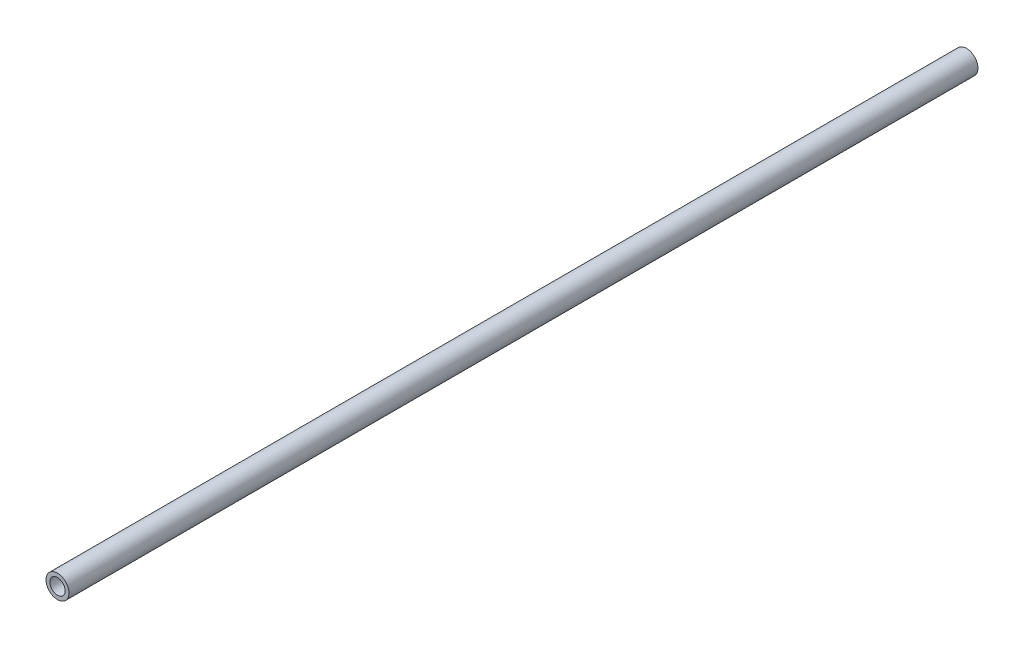
ISO-10303-21;
HEADER;
FILE_DESCRIPTION(('STEP AP214'),'2;1');
FILE_NAME('part.step','',(''),(''),'','','');
FILE_SCHEMA(('AUTOMOTIVE_DESIGN { 1 0 10303 214 1 1 1 1 }'));
ENDSEC;
DATA;
#1=APPLICATION_CONTEXT('core data for automotive mechanical design processes');
#2=APPLICATION_PROTOCOL_DEFINITION('international standard','automotive_design',2000,#1);
#3=PRODUCT_CONTEXT('',#1,'mechanical');
#4=PRODUCT('Part','Part','',(#3));
#5=PRODUCT_RELATED_PRODUCT_CATEGORY('part','',(#4));
#6=PRODUCT_DEFINITION_FORMATION('','',#4);
#7=PRODUCT_DEFINITION_CONTEXT('part definition',#1,'design');
#8=PRODUCT_DEFINITION('design','',#6,#7);
#9=PRODUCT_DEFINITION_SHAPE('','',#8);
#10=(LENGTH_UNIT() NAMED_UNIT(*) SI_UNIT(.MILLI.,.METRE.));
#11=(NAMED_UNIT(*) PLANE_ANGLE_UNIT() SI_UNIT($,.RADIAN.));
#12=(NAMED_UNIT(*) SI_UNIT($,.STERADIAN.) SOLID_ANGLE_UNIT());
#13=UNCERTAINTY_MEASURE_WITH_UNIT(LENGTH_MEASURE(1.E-05),#10,'distance_accuracy_value','');
#14=(GEOMETRIC_REPRESENTATION_CONTEXT(3) GLOBAL_UNCERTAINTY_ASSIGNED_CONTEXT((#13)) GLOBAL_UNIT_ASSIGNED_CONTEXT((#10,
#11,#12)) REPRESENTATION_CONTEXT('',''));
#15=CARTESIAN_POINT('',(0.,0.,0.));
#16=DIRECTION('',(0.,0.,1.));
#17=DIRECTION('',(1.,0.,0.));
#18=AXIS2_PLACEMENT_3D('',#15,#16,#17);
#19=CARTESIAN_POINT('',(0.,0.,948.));
#20=DIRECTION('',(0.,0.,1.));
#21=DIRECTION('',(1.,0.,0.));
#22=AXIS2_PLACEMENT_3D('',#19,#20,#21);
#23=PLANE('',#22);
#24=CARTESIAN_POINT('',(0.,0.,948.));
#25=DIRECTION('',(0.,0.,1.));
#26=DIRECTION('',(1.,0.,0.));
#27=AXIS2_PLACEMENT_3D('',#24,#25,#26);
#28=CIRCLE('',#27,12.);
#29=CARTESIAN_POINT('',(12.,0.,948.));
#30=VERTEX_POINT('',#29);
#31=EDGE_CURVE('E10',#30,#30,#28,.T.);
#32=ORIENTED_EDGE('',*,*,#31,.T.);
#33=EDGE_LOOP('',(#32));
#34=FACE_BOUND('',#33,.T.);
#35=CARTESIAN_POINT('',(0.,0.,948.));
#36=DIRECTION('',(0.,0.,1.));
#37=DIRECTION('',(1.,0.,0.));
#38=AXIS2_PLACEMENT_3D('',#35,#36,#37);
#39=CIRCLE('',#38,8.);
#40=CARTESIAN_POINT('',(8.,0.,948.));
#41=VERTEX_POINT('',#40);
#42=EDGE_CURVE('E54',#41,#41,#39,.T.);
#43=ORIENTED_EDGE('',*,*,#42,.F.);
#44=EDGE_LOOP('',(#43));
#45=FACE_BOUND('',#44,.T.);
#46=ADVANCED_FACE('F41',(#34,#45),#23,.T.);
#47=CARTESIAN_POINT('',(0.,0.,0.));
#48=DIRECTION('',(0.,0.,1.));
#49=DIRECTION('',(1.,0.,0.));
#50=AXIS2_PLACEMENT_3D('',#47,#48,#49);
#51=PLANE('',#50);
#52=CARTESIAN_POINT('',(0.,0.,0.));
#53=DIRECTION('',(0.,0.,1.));
#54=DIRECTION('',(1.,0.,0.));
#55=AXIS2_PLACEMENT_3D('',#52,#53,#54);
#56=CIRCLE('',#55,12.);
#57=CARTESIAN_POINT('',(12.,0.,0.));
#58=VERTEX_POINT('',#57);
#59=EDGE_CURVE('E45',#58,#58,#56,.T.);
#60=ORIENTED_EDGE('',*,*,#59,.F.);
#61=EDGE_LOOP('',(#60));
#62=FACE_BOUND('',#61,.T.);
#63=CARTESIAN_POINT('',(0.,0.,0.));
#64=DIRECTION('',(0.,0.,1.));
#65=DIRECTION('',(1.,0.,0.));
#66=AXIS2_PLACEMENT_3D('',#63,#64,#65);
#67=CIRCLE('',#66,8.);
#68=CARTESIAN_POINT('',(8.,0.,0.));
#69=VERTEX_POINT('',#68);
#70=EDGE_CURVE('E56',#69,#69,#67,.T.);
#71=ORIENTED_EDGE('',*,*,#70,.T.);
#72=EDGE_LOOP('',(#71));
#73=FACE_BOUND('',#72,.T.);
#74=ADVANCED_FACE('F68',(#62,#73),#51,.F.);
#75=CARTESIAN_POINT('',(0.,0.,948.));
#76=DIRECTION('',(0.,0.,-1.));
#77=DIRECTION('',(-1.,0.,0.));
#78=AXIS2_PLACEMENT_3D('',#75,#76,#77);
#79=CYLINDRICAL_SURFACE('',#78,12.);
#80=ORIENTED_EDGE('',*,*,#31,.F.);
#81=EDGE_LOOP('',(#80));
#82=FACE_BOUND('',#81,.T.);
#83=ORIENTED_EDGE('',*,*,#59,.T.);
#84=EDGE_LOOP('',(#83));
#85=FACE_BOUND('',#84,.T.);
#86=ADVANCED_FACE('F43',(#82,#85),#79,.T.);
#87=CARTESIAN_POINT('',(0.,0.,948.));
#88=DIRECTION('',(0.,0.,-1.));
#89=DIRECTION('',(-1.,0.,0.));
#90=AXIS2_PLACEMENT_3D('',#87,#88,#89);
#91=CYLINDRICAL_SURFACE('',#90,8.);
#92=ORIENTED_EDGE('',*,*,#42,.T.);
#93=EDGE_LOOP('',(#92));
#94=FACE_BOUND('',#93,.T.);
#95=ORIENTED_EDGE('',*,*,#70,.F.);
#96=EDGE_LOOP('',(#95));
#97=FACE_BOUND('',#96,.T.);
#98=ADVANCED_FACE('F64',(#94,#97),#91,.F.);
#99=CLOSED_SHELL('',(#46,#74,#86,#98));
#100=MANIFOLD_SOLID_BREP('B2',#99);
#101=ADVANCED_BREP_SHAPE_REPRESENTATION('',(#18,#100),#14);
#102=SHAPE_DEFINITION_REPRESENTATION(#9,#101);
ENDSEC;
END-ISO-10303-21;
